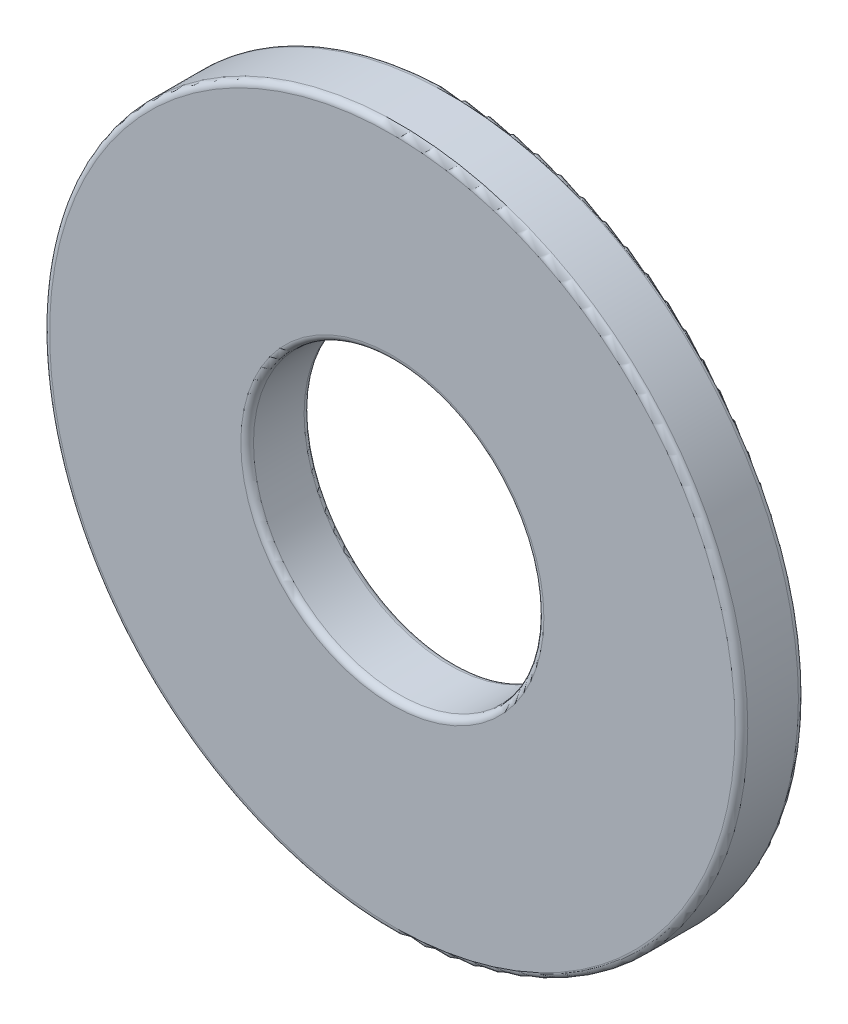
ISO-10303-21;
HEADER;
FILE_DESCRIPTION(('STEP AP214'),'2;1');
FILE_NAME('part.step','',(''),(''),'','','');
FILE_SCHEMA(('AUTOMOTIVE_DESIGN { 1 0 10303 214 1 1 1 1 }'));
ENDSEC;
DATA;
#1=APPLICATION_CONTEXT('core data for automotive mechanical design processes');
#2=APPLICATION_PROTOCOL_DEFINITION('international standard','automotive_design',2000,#1);
#3=PRODUCT_CONTEXT('',#1,'mechanical');
#4=PRODUCT('Part','Part','',(#3));
#5=PRODUCT_RELATED_PRODUCT_CATEGORY('part','',(#4));
#6=PRODUCT_DEFINITION_FORMATION('','',#4);
#7=PRODUCT_DEFINITION_CONTEXT('part definition',#1,'design');
#8=PRODUCT_DEFINITION('design','',#6,#7);
#9=PRODUCT_DEFINITION_SHAPE('','',#8);
#10=(LENGTH_UNIT() NAMED_UNIT(*) SI_UNIT(.MILLI.,.METRE.));
#11=(NAMED_UNIT(*) PLANE_ANGLE_UNIT() SI_UNIT($,.RADIAN.));
#12=(NAMED_UNIT(*) SI_UNIT($,.STERADIAN.) SOLID_ANGLE_UNIT());
#13=UNCERTAINTY_MEASURE_WITH_UNIT(LENGTH_MEASURE(1.E-05),#10,'distance_accuracy_value','');
#14=(GEOMETRIC_REPRESENTATION_CONTEXT(3) GLOBAL_UNCERTAINTY_ASSIGNED_CONTEXT((#13)) GLOBAL_UNIT_ASSIGNED_CONTEXT((#10,
#11,#12)) REPRESENTATION_CONTEXT('',''));
#15=CARTESIAN_POINT('',(0.,0.,0.));
#16=DIRECTION('',(0.,0.,1.));
#17=DIRECTION('',(1.,0.,0.));
#18=AXIS2_PLACEMENT_3D('',#15,#16,#17);
#19=CARTESIAN_POINT('',(0.,0.,-0.8636));
#20=DIRECTION('',(0.,0.,1.));
#21=DIRECTION('',(1.,0.,0.));
#22=AXIS2_PLACEMENT_3D('',#19,#20,#21);
#23=CYLINDRICAL_SURFACE('',#22,9.525);
#24=CARTESIAN_POINT('',(0.,0.,-0.69088));
#25=DIRECTION('',(0.,0.,1.));
#26=DIRECTION('',(1.,0.,0.));
#27=AXIS2_PLACEMENT_3D('',#24,#25,#26);
#28=CIRCLE('',#27,9.525);
#29=CARTESIAN_POINT('',(9.525,0.,-0.69088));
#30=VERTEX_POINT('',#29);
#31=EDGE_CURVE('E65',#30,#30,#28,.T.);
#32=ORIENTED_EDGE('',*,*,#31,.T.);
#33=EDGE_LOOP('',(#32));
#34=FACE_BOUND('',#33,.T.);
#35=CARTESIAN_POINT('',(0.,0.,0.69088));
#36=DIRECTION('',(0.,0.,1.));
#37=DIRECTION('',(1.,0.,0.));
#38=AXIS2_PLACEMENT_3D('',#35,#36,#37);
#39=CIRCLE('',#38,9.525);
#40=CARTESIAN_POINT('',(9.525,0.,0.69088));
#41=VERTEX_POINT('',#40);
#42=EDGE_CURVE('E68',#41,#41,#39,.F.);
#43=ORIENTED_EDGE('',*,*,#42,.T.);
#44=EDGE_LOOP('',(#43));
#45=FACE_BOUND('',#44,.T.);
#46=ADVANCED_FACE('F39',(#34,#45),#23,.T.);
#47=CARTESIAN_POINT('',(0.,0.,-0.8636));
#48=DIRECTION('',(0.,0.,1.));
#49=DIRECTION('',(1.,0.,0.));
#50=AXIS2_PLACEMENT_3D('',#47,#48,#49);
#51=PLANE('',#50);
#52=CARTESIAN_POINT('',(0.,0.,-0.8636));
#53=DIRECTION('',(0.,0.,1.));
#54=DIRECTION('',(1.,0.,0.));
#55=AXIS2_PLACEMENT_3D('',#52,#53,#54);
#56=CIRCLE('',#55,9.35228);
#57=CARTESIAN_POINT('',(9.35228,0.,-0.8636));
#58=VERTEX_POINT('',#57);
#59=EDGE_CURVE('E59',#58,#58,#56,.F.);
#60=ORIENTED_EDGE('',*,*,#59,.T.);
#61=EDGE_LOOP('',(#60));
#62=FACE_BOUND('',#61,.T.);
#63=CARTESIAN_POINT('',(0.,0.,-0.8636));
#64=DIRECTION('',(0.,0.,1.));
#65=DIRECTION('',(1.,0.,0.));
#66=AXIS2_PLACEMENT_3D('',#63,#64,#65);
#67=CIRCLE('',#66,4.13512);
#68=CARTESIAN_POINT('',(4.13512,0.,-0.8636));
#69=VERTEX_POINT('',#68);
#70=EDGE_CURVE('E62',#69,#69,#67,.T.);
#71=ORIENTED_EDGE('',*,*,#70,.T.);
#72=EDGE_LOOP('',(#71));
#73=FACE_BOUND('',#72,.T.);
#74=ADVANCED_FACE('F82',(#62,#73),#51,.F.);
#75=CARTESIAN_POINT('',(0.,0.,-0.8636));
#76=DIRECTION('',(0.,0.,1.));
#77=DIRECTION('',(1.,0.,0.));
#78=AXIS2_PLACEMENT_3D('',#75,#76,#77);
#79=CYLINDRICAL_SURFACE('',#78,3.9624);
#80=CARTESIAN_POINT('',(0.,0.,-0.69088));
#81=DIRECTION('',(0.,0.,1.));
#82=DIRECTION('',(1.,0.,0.));
#83=AXIS2_PLACEMENT_3D('',#80,#81,#82);
#84=CIRCLE('',#83,3.9624);
#85=CARTESIAN_POINT('',(3.9624,0.,-0.69088));
#86=VERTEX_POINT('',#85);
#87=EDGE_CURVE('E50',#86,#86,#84,.F.);
#88=ORIENTED_EDGE('',*,*,#87,.T.);
#89=EDGE_LOOP('',(#88));
#90=FACE_BOUND('',#89,.T.);
#91=CARTESIAN_POINT('',(0.,0.,0.69088));
#92=DIRECTION('',(0.,0.,1.));
#93=DIRECTION('',(1.,0.,0.));
#94=AXIS2_PLACEMENT_3D('',#91,#92,#93);
#95=CIRCLE('',#94,3.9624);
#96=CARTESIAN_POINT('',(3.9624,0.,0.69088));
#97=VERTEX_POINT('',#96);
#98=EDGE_CURVE('E54',#97,#97,#95,.T.);
#99=ORIENTED_EDGE('',*,*,#98,.T.);
#100=EDGE_LOOP('',(#99));
#101=FACE_BOUND('',#100,.T.);
#102=ADVANCED_FACE('F88',(#90,#101),#79,.F.);
#103=CARTESIAN_POINT('',(0.,0.,0.8636));
#104=DIRECTION('',(0.,0.,1.));
#105=DIRECTION('',(1.,0.,0.));
#106=AXIS2_PLACEMENT_3D('',#103,#104,#105);
#107=PLANE('',#106);
#108=CARTESIAN_POINT('',(0.,0.,0.8636));
#109=DIRECTION('',(0.,0.,1.));
#110=DIRECTION('',(1.,0.,0.));
#111=AXIS2_PLACEMENT_3D('',#108,#109,#110);
#112=CIRCLE('',#111,4.13512);
#113=CARTESIAN_POINT('',(4.13512,0.,0.8636));
#114=VERTEX_POINT('',#113);
#115=EDGE_CURVE('E10',#114,#114,#112,.F.);
#116=ORIENTED_EDGE('',*,*,#115,.T.);
#117=EDGE_LOOP('',(#116));
#118=FACE_BOUND('',#117,.T.);
#119=CARTESIAN_POINT('',(0.,0.,0.8636));
#120=DIRECTION('',(0.,0.,1.));
#121=DIRECTION('',(1.,0.,0.));
#122=AXIS2_PLACEMENT_3D('',#119,#120,#121);
#123=CIRCLE('',#122,9.35228);
#124=CARTESIAN_POINT('',(9.35228,0.,0.8636));
#125=VERTEX_POINT('',#124);
#126=EDGE_CURVE('E46',#125,#125,#123,.T.);
#127=ORIENTED_EDGE('',*,*,#126,.T.);
#128=EDGE_LOOP('',(#127));
#129=FACE_BOUND('',#128,.T.);
#130=ADVANCED_FACE('F96',(#118,#129),#107,.T.);
#131=CARTESIAN_POINT('',(0.,0.,-0.69088));
#132=DIRECTION('',(0.,0.,1.));
#133=DIRECTION('',(1.,0.,0.));
#134=AXIS2_PLACEMENT_3D('',#131,#132,#133);
#135=TOROIDAL_SURFACE('',#134,9.35228,0.17272);
#136=ORIENTED_EDGE('',*,*,#59,.F.);
#137=EDGE_LOOP('',(#136));
#138=FACE_BOUND('',#137,.T.);
#139=ORIENTED_EDGE('',*,*,#31,.F.);
#140=EDGE_LOOP('',(#139));
#141=FACE_BOUND('',#140,.T.);
#142=ADVANCED_FACE('F93',(#138,#141),#135,.T.);
#143=CARTESIAN_POINT('',(0.,0.,-0.69088));
#144=DIRECTION('',(0.,0.,1.));
#145=DIRECTION('',(1.,0.,0.));
#146=AXIS2_PLACEMENT_3D('',#143,#144,#145);
#147=TOROIDAL_SURFACE('',#146,4.13512,0.17272);
#148=ORIENTED_EDGE('',*,*,#87,.F.);
#149=EDGE_LOOP('',(#148));
#150=FACE_BOUND('',#149,.T.);
#151=ORIENTED_EDGE('',*,*,#70,.F.);
#152=EDGE_LOOP('',(#151));
#153=FACE_BOUND('',#152,.T.);
#154=ADVANCED_FACE('F79',(#150,#153),#147,.T.);
#155=CARTESIAN_POINT('',(0.,0.,0.69088));
#156=DIRECTION('',(0.,0.,1.));
#157=DIRECTION('',(1.,0.,0.));
#158=AXIS2_PLACEMENT_3D('',#155,#156,#157);
#159=TOROIDAL_SURFACE('',#158,4.13512,0.17272);
#160=ORIENTED_EDGE('',*,*,#115,.F.);
#161=EDGE_LOOP('',(#160));
#162=FACE_BOUND('',#161,.T.);
#163=ORIENTED_EDGE('',*,*,#98,.F.);
#164=EDGE_LOOP('',(#163));
#165=FACE_BOUND('',#164,.T.);
#166=ADVANCED_FACE('F75',(#162,#165),#159,.T.);
#167=CARTESIAN_POINT('',(0.,0.,0.69088));
#168=DIRECTION('',(0.,0.,1.));
#169=DIRECTION('',(1.,0.,0.));
#170=AXIS2_PLACEMENT_3D('',#167,#168,#169);
#171=TOROIDAL_SURFACE('',#170,9.35228,0.17272);
#172=ORIENTED_EDGE('',*,*,#42,.F.);
#173=EDGE_LOOP('',(#172));
#174=FACE_BOUND('',#173,.T.);
#175=ORIENTED_EDGE('',*,*,#126,.F.);
#176=EDGE_LOOP('',(#175));
#177=FACE_BOUND('',#176,.T.);
#178=ADVANCED_FACE('F41',(#174,#177),#171,.T.);
#179=CLOSED_SHELL('',(#46,#74,#102,#130,#142,#154,#166,#178));
#180=MANIFOLD_SOLID_BREP('B2',#179);
#181=ADVANCED_BREP_SHAPE_REPRESENTATION('',(#18,#180),#14);
#182=SHAPE_DEFINITION_REPRESENTATION(#9,#181);
ENDSEC;
END-ISO-10303-21;
